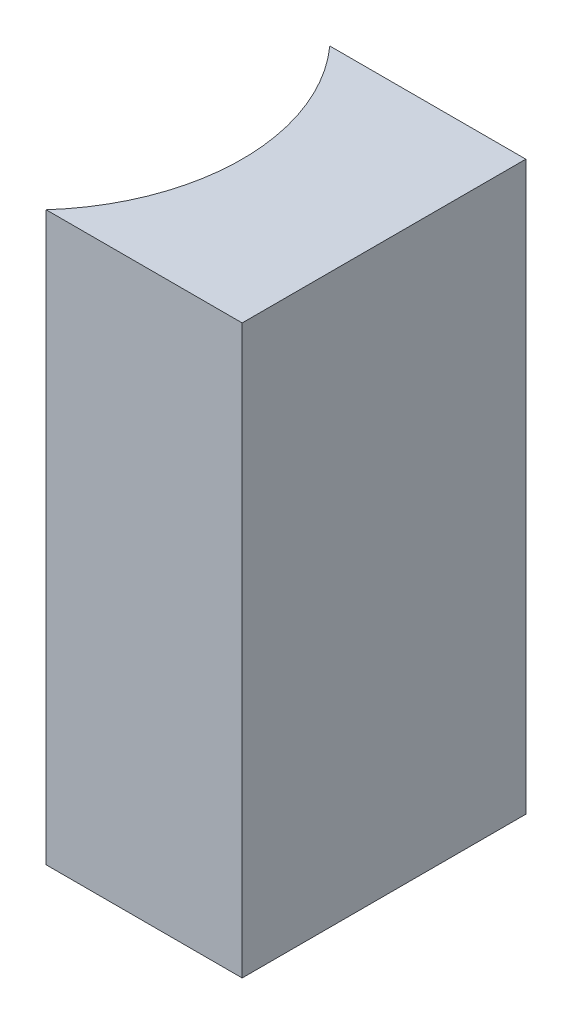
ISO-10303-21;
HEADER;
FILE_DESCRIPTION(('STEP AP214'),'2;1');
FILE_NAME('part.step','',(''),(''),'','','');
FILE_SCHEMA(('AUTOMOTIVE_DESIGN { 1 0 10303 214 1 1 1 1 }'));
ENDSEC;
DATA;
#1=APPLICATION_CONTEXT('core data for automotive mechanical design processes');
#2=APPLICATION_PROTOCOL_DEFINITION('international standard','automotive_design',2000,#1);
#3=PRODUCT_CONTEXT('',#1,'mechanical');
#4=PRODUCT('Part','Part','',(#3));
#5=PRODUCT_RELATED_PRODUCT_CATEGORY('part','',(#4));
#6=PRODUCT_DEFINITION_FORMATION('','',#4);
#7=PRODUCT_DEFINITION_CONTEXT('part definition',#1,'design');
#8=PRODUCT_DEFINITION('design','',#6,#7);
#9=PRODUCT_DEFINITION_SHAPE('','',#8);
#10=(LENGTH_UNIT() NAMED_UNIT(*) SI_UNIT(.MILLI.,.METRE.));
#11=(NAMED_UNIT(*) PLANE_ANGLE_UNIT() SI_UNIT($,.RADIAN.));
#12=(NAMED_UNIT(*) SI_UNIT($,.STERADIAN.) SOLID_ANGLE_UNIT());
#13=UNCERTAINTY_MEASURE_WITH_UNIT(LENGTH_MEASURE(1.E-05),#10,'distance_accuracy_value','');
#14=(GEOMETRIC_REPRESENTATION_CONTEXT(3) GLOBAL_UNCERTAINTY_ASSIGNED_CONTEXT((#13)) GLOBAL_UNIT_ASSIGNED_CONTEXT((#10,
#11,#12)) REPRESENTATION_CONTEXT('',''));
#15=CARTESIAN_POINT('',(0.,0.,0.));
#16=DIRECTION('',(0.,0.,1.));
#17=DIRECTION('',(1.,0.,0.));
#18=AXIS2_PLACEMENT_3D('',#15,#16,#17);
#19=CARTESIAN_POINT('',(0.,8.,0.));
#20=DIRECTION('',(0.,0.,1.));
#21=DIRECTION('',(1.,0.,0.));
#22=AXIS2_PLACEMENT_3D('',#19,#20,#21);
#23=PLANE('',#22);
#24=DIRECTION('',(-1.,0.,0.));
#25=VECTOR('',#24,1.);
#26=CARTESIAN_POINT('',(0.,0.,0.));
#27=LINE('',#26,#25);
#28=CARTESIAN_POINT('',(0.,0.,0.));
#29=VERTEX_POINT('',#28);
#30=CARTESIAN_POINT('',(-2.76393202250021,0.,0.));
#31=VERTEX_POINT('',#30);
#32=EDGE_CURVE('E100',#29,#31,#27,.T.);
#33=ORIENTED_EDGE('',*,*,#32,.T.);
#34=DIRECTION('',(0.,-1.,0.));
#35=VECTOR('',#34,1.);
#36=CARTESIAN_POINT('',(-2.76393202250021,8.,0.));
#37=LINE('',#36,#35);
#38=CARTESIAN_POINT('',(-2.76393202250021,8.,0.));
#39=VERTEX_POINT('',#38);
#40=EDGE_CURVE('E11',#39,#31,#37,.T.);
#41=ORIENTED_EDGE('',*,*,#40,.F.);
#42=DIRECTION('',(-1.,0.,0.));
#43=VECTOR('',#42,1.);
#44=CARTESIAN_POINT('',(0.,8.,0.));
#45=LINE('',#44,#43);
#46=CARTESIAN_POINT('',(0.,8.,0.));
#47=VERTEX_POINT('',#46);
#48=EDGE_CURVE('E88',#47,#39,#45,.T.);
#49=ORIENTED_EDGE('',*,*,#48,.F.);
#50=DIRECTION('',(0.,-1.,0.));
#51=VECTOR('',#50,1.);
#52=CARTESIAN_POINT('',(0.,8.,0.));
#53=LINE('',#52,#51);
#54=EDGE_CURVE('E96',#47,#29,#53,.T.);
#55=ORIENTED_EDGE('',*,*,#54,.T.);
#56=EDGE_LOOP('',(#33,#41,#49,#55));
#57=FACE_BOUND('',#56,.T.);
#58=ADVANCED_FACE('F37',(#57),#23,.F.);
#59=CARTESIAN_POINT('',(-5.,8.,2.));
#60=DIRECTION('',(0.,-1.,0.));
#61=DIRECTION('',(0.,0.,-1.));
#62=AXIS2_PLACEMENT_3D('',#59,#60,#61);
#63=CYLINDRICAL_SURFACE('',#62,3.);
#64=CARTESIAN_POINT('',(-5.,0.,2.));
#65=DIRECTION('',(0.,-1.,0.));
#66=DIRECTION('',(0.,0.,1.));
#67=AXIS2_PLACEMENT_3D('',#64,#65,#66);
#68=CIRCLE('',#67,3.);
#69=CARTESIAN_POINT('',(-2.76393202250021,0.,4.));
#70=VERTEX_POINT('',#69);
#71=EDGE_CURVE('E92',#31,#70,#68,.T.);
#72=ORIENTED_EDGE('',*,*,#71,.T.);
#73=DIRECTION('',(0.,-1.,0.));
#74=VECTOR('',#73,1.);
#75=CARTESIAN_POINT('',(-2.76393202250021,8.,4.));
#76=LINE('',#75,#74);
#77=CARTESIAN_POINT('',(-2.76393202250021,8.,4.));
#78=VERTEX_POINT('',#77);
#79=EDGE_CURVE('E45',#78,#70,#76,.T.);
#80=ORIENTED_EDGE('',*,*,#79,.F.);
#81=CARTESIAN_POINT('',(-5.,8.,2.));
#82=DIRECTION('',(0.,-1.,0.));
#83=DIRECTION('',(0.,0.,1.));
#84=AXIS2_PLACEMENT_3D('',#81,#82,#83);
#85=CIRCLE('',#84,3.);
#86=EDGE_CURVE('E83',#39,#78,#85,.T.);
#87=ORIENTED_EDGE('',*,*,#86,.F.);
#88=ORIENTED_EDGE('',*,*,#40,.T.);
#89=EDGE_LOOP('',(#72,#80,#87,#88));
#90=FACE_BOUND('',#89,.T.);
#91=ADVANCED_FACE('F91',(#90),#63,.F.);
#92=CARTESIAN_POINT('',(0.,8.,4.));
#93=DIRECTION('',(0.,0.,-1.));
#94=DIRECTION('',(-1.,0.,0.));
#95=AXIS2_PLACEMENT_3D('',#92,#93,#94);
#96=PLANE('',#95);
#97=DIRECTION('',(1.,0.,0.));
#98=VECTOR('',#97,1.);
#99=CARTESIAN_POINT('',(0.,0.,4.));
#100=LINE('',#99,#98);
#101=CARTESIAN_POINT('',(0.,0.,4.));
#102=VERTEX_POINT('',#101);
#103=EDGE_CURVE('E70',#70,#102,#100,.T.);
#104=ORIENTED_EDGE('',*,*,#103,.T.);
#105=DIRECTION('',(0.,-1.,0.));
#106=VECTOR('',#105,1.);
#107=CARTESIAN_POINT('',(0.,8.,4.));
#108=LINE('',#107,#106);
#109=CARTESIAN_POINT('',(0.,8.,4.));
#110=VERTEX_POINT('',#109);
#111=EDGE_CURVE('E93',#110,#102,#108,.T.);
#112=ORIENTED_EDGE('',*,*,#111,.F.);
#113=DIRECTION('',(1.,0.,0.));
#114=VECTOR('',#113,1.);
#115=CARTESIAN_POINT('',(0.,8.,4.));
#116=LINE('',#115,#114);
#117=EDGE_CURVE('E86',#78,#110,#116,.T.);
#118=ORIENTED_EDGE('',*,*,#117,.F.);
#119=ORIENTED_EDGE('',*,*,#79,.T.);
#120=EDGE_LOOP('',(#104,#112,#118,#119));
#121=FACE_BOUND('',#120,.T.);
#122=ADVANCED_FACE('F94',(#121),#96,.F.);
#123=CARTESIAN_POINT('',(0.,8.,0.));
#124=DIRECTION('',(-1.,0.,0.));
#125=DIRECTION('',(0.,0.,1.));
#126=AXIS2_PLACEMENT_3D('',#123,#124,#125);
#127=PLANE('',#126);
#128=DIRECTION('',(0.,0.,-1.));
#129=VECTOR('',#128,1.);
#130=CARTESIAN_POINT('',(0.,0.,0.));
#131=LINE('',#130,#129);
#132=EDGE_CURVE('E76',#102,#29,#131,.T.);
#133=ORIENTED_EDGE('',*,*,#132,.T.);
#134=ORIENTED_EDGE('',*,*,#54,.F.);
#135=DIRECTION('',(0.,0.,-1.));
#136=VECTOR('',#135,1.);
#137=CARTESIAN_POINT('',(0.,8.,0.));
#138=LINE('',#137,#136);
#139=EDGE_CURVE('E53',#110,#47,#138,.T.);
#140=ORIENTED_EDGE('',*,*,#139,.F.);
#141=ORIENTED_EDGE('',*,*,#111,.T.);
#142=EDGE_LOOP('',(#133,#134,#140,#141));
#143=FACE_BOUND('',#142,.T.);
#144=ADVANCED_FACE('F107',(#143),#127,.F.);
#145=CARTESIAN_POINT('',(-5.,8.,2.));
#146=DIRECTION('',(0.,1.,0.));
#147=DIRECTION('',(0.,0.,1.));
#148=AXIS2_PLACEMENT_3D('',#145,#146,#147);
#149=PLANE('',#148);
#150=ORIENTED_EDGE('',*,*,#48,.T.);
#151=ORIENTED_EDGE('',*,*,#86,.T.);
#152=ORIENTED_EDGE('',*,*,#117,.T.);
#153=ORIENTED_EDGE('',*,*,#139,.T.);
#154=EDGE_LOOP('',(#150,#151,#152,#153));
#155=FACE_BOUND('',#154,.T.);
#156=ADVANCED_FACE('F84',(#155),#149,.T.);
#157=CARTESIAN_POINT('',(-5.,0.,2.));
#158=DIRECTION('',(0.,1.,0.));
#159=DIRECTION('',(0.,0.,1.));
#160=AXIS2_PLACEMENT_3D('',#157,#158,#159);
#161=PLANE('',#160);
#162=ORIENTED_EDGE('',*,*,#32,.F.);
#163=ORIENTED_EDGE('',*,*,#132,.F.);
#164=ORIENTED_EDGE('',*,*,#103,.F.);
#165=ORIENTED_EDGE('',*,*,#71,.F.);
#166=EDGE_LOOP('',(#162,#163,#164,#165));
#167=FACE_BOUND('',#166,.T.);
#168=ADVANCED_FACE('F110',(#167),#161,.F.);
#169=CLOSED_SHELL('',(#58,#91,#122,#144,#156,#168));
#170=MANIFOLD_SOLID_BREP('B2',#169);
#171=ADVANCED_BREP_SHAPE_REPRESENTATION('',(#18,#170),#14);
#172=SHAPE_DEFINITION_REPRESENTATION(#9,#171);
ENDSEC;
END-ISO-10303-21;
